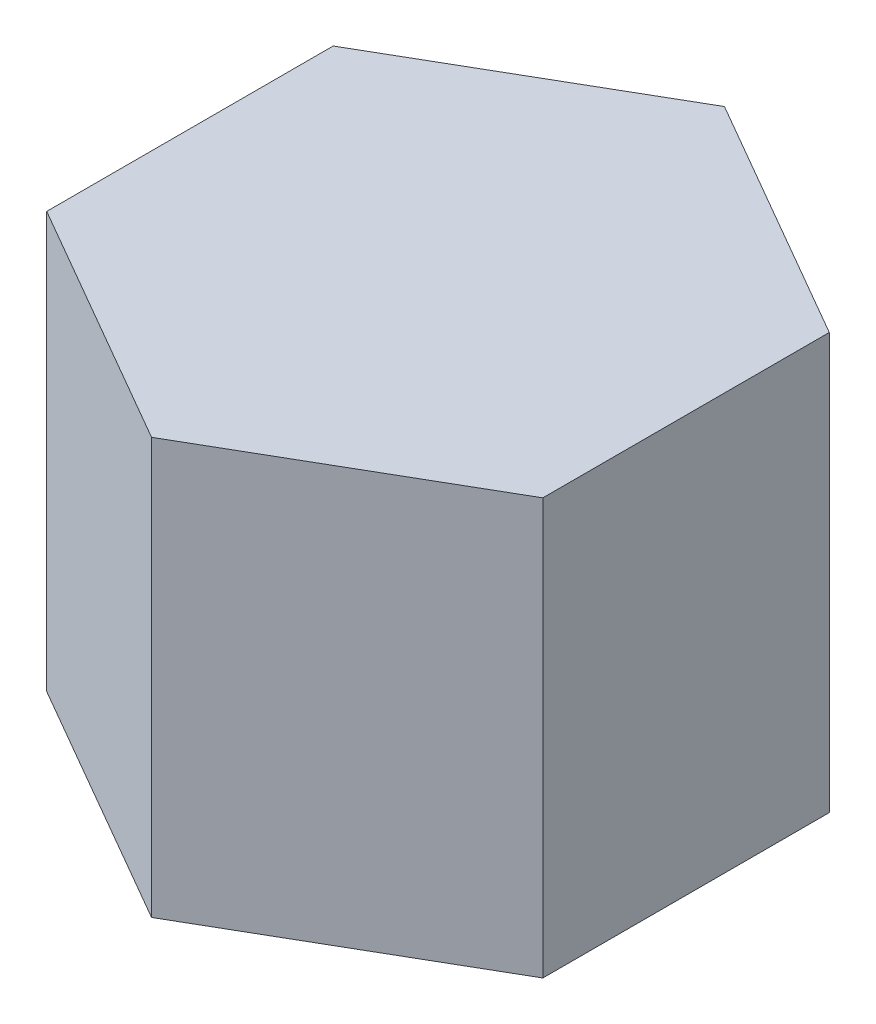
ISO-10303-21;
HEADER;
FILE_DESCRIPTION(('STEP AP214'),'2;1');
FILE_NAME('part.step','',(''),(''),'','','');
FILE_SCHEMA(('AUTOMOTIVE_DESIGN { 1 0 10303 214 1 1 1 1 }'));
ENDSEC;
DATA;
#1=APPLICATION_CONTEXT('core data for automotive mechanical design processes');
#2=APPLICATION_PROTOCOL_DEFINITION('international standard','automotive_design',2000,#1);
#3=PRODUCT_CONTEXT('',#1,'mechanical');
#4=PRODUCT('Part','Part','',(#3));
#5=PRODUCT_RELATED_PRODUCT_CATEGORY('part','',(#4));
#6=PRODUCT_DEFINITION_FORMATION('','',#4);
#7=PRODUCT_DEFINITION_CONTEXT('part definition',#1,'design');
#8=PRODUCT_DEFINITION('design','',#6,#7);
#9=PRODUCT_DEFINITION_SHAPE('','',#8);
#10=(LENGTH_UNIT() NAMED_UNIT(*) SI_UNIT(.MILLI.,.METRE.));
#11=(NAMED_UNIT(*) PLANE_ANGLE_UNIT() SI_UNIT($,.RADIAN.));
#12=(NAMED_UNIT(*) SI_UNIT($,.STERADIAN.) SOLID_ANGLE_UNIT());
#13=UNCERTAINTY_MEASURE_WITH_UNIT(LENGTH_MEASURE(1.E-05),#10,'distance_accuracy_value','');
#14=(GEOMETRIC_REPRESENTATION_CONTEXT(3) GLOBAL_UNCERTAINTY_ASSIGNED_CONTEXT((#13)) GLOBAL_UNIT_ASSIGNED_CONTEXT((#10,
#11,#12)) REPRESENTATION_CONTEXT('',''));
#15=CARTESIAN_POINT('',(0.,0.,0.));
#16=DIRECTION('',(0.,0.,1.));
#17=DIRECTION('',(1.,0.,0.));
#18=AXIS2_PLACEMENT_3D('',#15,#16,#17);
#19=CARTESIAN_POINT('',(206.642660308706,-148.537700895744,293.239022028063));
#20=DIRECTION('',(-0.499999999999909,0.,-0.866025403784491));
#21=DIRECTION('',(-0.866025403784491,0.,0.499999999999909));
#22=AXIS2_PLACEMENT_3D('',#19,#20,#21);
#23=PLANE('',#22);
#24=CARTESIAN_POINT('',(206.339551417382,-149.045793579175,293.414022028063));
#25=DIRECTION('',(0.866025403784491,0.,-0.499999999999909));
#26=VECTOR('',#25,1.);
#27=LINE('',#24,#26);
#28=CARTESIAN_POINT('',(206.339551417382,-149.045793579175,293.414022028063));
#29=VERTEX_POINT('',#28);
#30=CARTESIAN_POINT('',(206.642660308706,-149.045793579175,293.239022028063));
#31=VERTEX_POINT('',#30);
#32=EDGE_CURVE('E170',#29,#31,#27,.T.);
#33=ORIENTED_EDGE('',*,*,#32,.T.);
#34=CARTESIAN_POINT('',(206.642660308706,-148.537700895744,293.239022028063));
#35=DIRECTION('',(0.,-1.,0.));
#36=VECTOR('',#35,1.);
#37=LINE('',#34,#36);
#38=CARTESIAN_POINT('',(206.642660308706,-148.537700895744,293.239022028063));
#39=VERTEX_POINT('',#38);
#40=EDGE_CURVE('E35',#39,#31,#37,.T.);
#41=ORIENTED_EDGE('',*,*,#40,.F.);
#42=CARTESIAN_POINT('',(206.339551417382,-148.537700895744,293.414022028063));
#43=DIRECTION('',(0.866025403784491,0.,-0.499999999999909));
#44=VECTOR('',#43,1.);
#45=LINE('',#42,#44);
#46=CARTESIAN_POINT('',(206.339551417382,-148.537700895744,293.414022028063));
#47=VERTEX_POINT('',#46);
#48=EDGE_CURVE('E159',#47,#39,#45,.T.);
#49=ORIENTED_EDGE('',*,*,#48,.F.);
#50=CARTESIAN_POINT('',(206.339551417382,-148.537700895744,293.414022028063));
#51=DIRECTION('',(0.,-1.,0.));
#52=VECTOR('',#51,1.);
#53=LINE('',#50,#52);
#54=EDGE_CURVE('E10',#47,#29,#53,.T.);
#55=ORIENTED_EDGE('',*,*,#54,.T.);
#56=EDGE_LOOP('',(#33,#41,#49,#55));
#57=FACE_BOUND('',#56,.T.);
#58=ADVANCED_FACE('F16',(#57),#23,.F.);
#59=CARTESIAN_POINT('',(206.339551417382,-148.537700895744,293.414022028063));
#60=DIRECTION('',(0.500000000000062,0.,-0.866025403784403));
#61=DIRECTION('',(-0.866025403784403,0.,-0.500000000000062));
#62=AXIS2_PLACEMENT_3D('',#59,#60,#61);
#63=PLANE('',#62);
#64=CARTESIAN_POINT('',(206.036442526057,-149.045793579175,293.239022028063));
#65=DIRECTION('',(0.866025403784403,0.,0.500000000000062));
#66=VECTOR('',#65,1.);
#67=LINE('',#64,#66);
#68=CARTESIAN_POINT('',(206.036442526057,-149.045793579175,293.239022028063));
#69=VERTEX_POINT('',#68);
#70=EDGE_CURVE('E167',#69,#29,#67,.T.);
#71=ORIENTED_EDGE('',*,*,#70,.T.);
#72=ORIENTED_EDGE('',*,*,#54,.F.);
#73=CARTESIAN_POINT('',(206.036442526057,-148.537700895744,293.239022028063));
#74=DIRECTION('',(0.866025403784403,0.,0.500000000000062));
#75=VECTOR('',#74,1.);
#76=LINE('',#73,#75);
#77=CARTESIAN_POINT('',(206.036442526057,-148.537700895744,293.239022028063));
#78=VERTEX_POINT('',#77);
#79=EDGE_CURVE('E156',#78,#47,#76,.T.);
#80=ORIENTED_EDGE('',*,*,#79,.F.);
#81=CARTESIAN_POINT('',(206.036442526057,-148.537700895744,293.239022028063));
#82=DIRECTION('',(0.,-1.,0.));
#83=VECTOR('',#82,1.);
#84=LINE('',#81,#83);
#85=EDGE_CURVE('E27',#78,#69,#84,.T.);
#86=ORIENTED_EDGE('',*,*,#85,.T.);
#87=EDGE_LOOP('',(#71,#72,#80,#86));
#88=FACE_BOUND('',#87,.T.);
#89=ADVANCED_FACE('F189',(#88),#63,.F.);
#90=CARTESIAN_POINT('',(206.036442526057,-148.537700895744,290.831971220494));
#91=DIRECTION('',(1.,0.,0.));
#92=DIRECTION('',(0.,1.,0.));
#93=AXIS2_PLACEMENT_3D('',#90,#91,#92);
#94=PLANE('',#93);
#95=CARTESIAN_POINT('',(206.036442526057,-149.045793579175,292.889022028063));
#96=DIRECTION('',(0.,0.,1.));
#97=VECTOR('',#96,1.);
#98=LINE('',#95,#97);
#99=CARTESIAN_POINT('',(206.036442526057,-149.045793579175,292.889022028063));
#100=VERTEX_POINT('',#99);
#101=EDGE_CURVE('E163',#100,#69,#98,.T.);
#102=ORIENTED_EDGE('',*,*,#101,.T.);
#103=ORIENTED_EDGE('',*,*,#85,.F.);
#104=CARTESIAN_POINT('',(206.036442526057,-148.537700895744,292.889022028063));
#105=DIRECTION('',(0.,0.,1.));
#106=VECTOR('',#105,1.);
#107=LINE('',#104,#106);
#108=CARTESIAN_POINT('',(206.036442526057,-148.537700895744,292.889022028063));
#109=VERTEX_POINT('',#108);
#110=EDGE_CURVE('E106',#109,#78,#107,.T.);
#111=ORIENTED_EDGE('',*,*,#110,.F.);
#112=CARTESIAN_POINT('',(206.036442526057,-148.537700895744,292.889022028063));
#113=DIRECTION('',(0.,-1.,0.));
#114=VECTOR('',#113,1.);
#115=LINE('',#112,#114);
#116=EDGE_CURVE('E94',#109,#100,#115,.T.);
#117=ORIENTED_EDGE('',*,*,#116,.T.);
#118=EDGE_LOOP('',(#102,#103,#111,#117));
#119=FACE_BOUND('',#118,.T.);
#120=ADVANCED_FACE('F198',(#119),#94,.F.);
#121=CARTESIAN_POINT('',(206.036442526057,-148.537700895744,292.889022028063));
#122=DIRECTION('',(0.499999999999943,0.,0.866025403784472));
#123=DIRECTION('',(0.866025403784472,0.,-0.499999999999943));
#124=AXIS2_PLACEMENT_3D('',#121,#122,#123);
#125=PLANE('',#124);
#126=CARTESIAN_POINT('',(206.339551417382,-149.045793579175,292.714022028063));
#127=DIRECTION('',(-0.866025403784471,0.,0.499999999999943));
#128=VECTOR('',#127,1.);
#129=LINE('',#126,#128);
#130=CARTESIAN_POINT('',(206.339551417382,-149.045793579175,292.714022028063));
#131=VERTEX_POINT('',#130);
#132=EDGE_CURVE('E162',#131,#100,#129,.T.);
#133=ORIENTED_EDGE('',*,*,#132,.T.);
#134=ORIENTED_EDGE('',*,*,#116,.F.);
#135=CARTESIAN_POINT('',(206.339551417382,-148.537700895744,292.714022028063));
#136=DIRECTION('',(-0.866025403784471,0.,0.499999999999943));
#137=VECTOR('',#136,1.);
#138=LINE('',#135,#137);
#139=CARTESIAN_POINT('',(206.339551417382,-148.537700895744,292.714022028063));
#140=VERTEX_POINT('',#139);
#141=EDGE_CURVE('E98',#140,#109,#138,.T.);
#142=ORIENTED_EDGE('',*,*,#141,.F.);
#143=CARTESIAN_POINT('',(206.339551417382,-148.537700895744,292.714022028063));
#144=DIRECTION('',(0.,-1.,0.));
#145=VECTOR('',#144,1.);
#146=LINE('',#143,#145);
#147=EDGE_CURVE('E79',#140,#131,#146,.T.);
#148=ORIENTED_EDGE('',*,*,#147,.T.);
#149=EDGE_LOOP('',(#133,#134,#142,#148));
#150=FACE_BOUND('',#149,.T.);
#151=ADVANCED_FACE('F100',(#150),#125,.F.);
#152=CARTESIAN_POINT('',(206.339551417382,-148.537700895744,292.714022028063));
#153=DIRECTION('',(-0.500000000000096,0.,0.866025403784383));
#154=DIRECTION('',(0.866025403784383,0.,0.500000000000096));
#155=AXIS2_PLACEMENT_3D('',#152,#153,#154);
#156=PLANE('',#155);
#157=CARTESIAN_POINT('',(206.642660308706,-149.045793579175,292.889022028063));
#158=DIRECTION('',(-0.866025403784383,0.,-0.500000000000096));
#159=VECTOR('',#158,1.);
#160=LINE('',#157,#159);
#161=CARTESIAN_POINT('',(206.642660308706,-149.045793579175,292.889022028063));
#162=VERTEX_POINT('',#161);
#163=EDGE_CURVE('E88',#162,#131,#160,.T.);
#164=ORIENTED_EDGE('',*,*,#163,.T.);
#165=ORIENTED_EDGE('',*,*,#147,.F.);
#166=CARTESIAN_POINT('',(206.642660308706,-148.537700895744,292.889022028063));
#167=DIRECTION('',(-0.866025403784383,0.,-0.500000000000096));
#168=VECTOR('',#167,1.);
#169=LINE('',#166,#168);
#170=CARTESIAN_POINT('',(206.642660308706,-148.537700895744,292.889022028063));
#171=VERTEX_POINT('',#170);
#172=EDGE_CURVE('E84',#171,#140,#169,.T.);
#173=ORIENTED_EDGE('',*,*,#172,.F.);
#174=CARTESIAN_POINT('',(206.642660308706,-148.537700895744,292.889022028063));
#175=DIRECTION('',(0.,-1.,0.));
#176=VECTOR('',#175,1.);
#177=LINE('',#174,#176);
#178=EDGE_CURVE('E58',#171,#162,#177,.T.);
#179=ORIENTED_EDGE('',*,*,#178,.T.);
#180=EDGE_LOOP('',(#164,#165,#173,#179));
#181=FACE_BOUND('',#180,.T.);
#182=ADVANCED_FACE('F82',(#181),#156,.F.);
#183=CARTESIAN_POINT('',(206.642660308706,-148.537700895744,290.831971220494));
#184=DIRECTION('',(-1.,0.,0.));
#185=DIRECTION('',(0.,-1.,0.));
#186=AXIS2_PLACEMENT_3D('',#183,#184,#185);
#187=PLANE('',#186);
#188=CARTESIAN_POINT('',(206.642660308706,-149.045793579175,293.239022028063));
#189=DIRECTION('',(0.,0.,-1.));
#190=VECTOR('',#189,1.);
#191=LINE('',#188,#190);
#192=EDGE_CURVE('E160',#31,#162,#191,.T.);
#193=ORIENTED_EDGE('',*,*,#192,.T.);
#194=ORIENTED_EDGE('',*,*,#178,.F.);
#195=CARTESIAN_POINT('',(206.642660308706,-148.537700895744,293.239022028063));
#196=DIRECTION('',(0.,0.,-1.));
#197=VECTOR('',#196,1.);
#198=LINE('',#195,#197);
#199=EDGE_CURVE('E112',#39,#171,#198,.T.);
#200=ORIENTED_EDGE('',*,*,#199,.F.);
#201=ORIENTED_EDGE('',*,*,#40,.T.);
#202=EDGE_LOOP('',(#193,#194,#200,#201));
#203=FACE_BOUND('',#202,.T.);
#204=ADVANCED_FACE('F131',(#203),#187,.F.);
#205=CARTESIAN_POINT('',(206.339551417382,-148.537700895744,290.831971220494));
#206=DIRECTION('',(0.,-1.,0.));
#207=DIRECTION('',(1.,0.,0.));
#208=AXIS2_PLACEMENT_3D('',#205,#206,#207);
#209=PLANE('',#208);
#210=ORIENTED_EDGE('',*,*,#48,.T.);
#211=ORIENTED_EDGE('',*,*,#199,.T.);
#212=ORIENTED_EDGE('',*,*,#172,.T.);
#213=ORIENTED_EDGE('',*,*,#141,.T.);
#214=ORIENTED_EDGE('',*,*,#110,.T.);
#215=ORIENTED_EDGE('',*,*,#79,.T.);
#216=EDGE_LOOP('',(#210,#211,#212,#213,#214,#215));
#217=FACE_BOUND('',#216,.T.);
#218=ADVANCED_FACE('F111',(#217),#209,.F.);
#219=CARTESIAN_POINT('',(206.339551417382,-149.045793579175,290.831971220494));
#220=DIRECTION('',(0.,-1.,0.));
#221=DIRECTION('',(1.,0.,0.));
#222=AXIS2_PLACEMENT_3D('',#219,#220,#221);
#223=PLANE('',#222);
#224=ORIENTED_EDGE('',*,*,#32,.F.);
#225=ORIENTED_EDGE('',*,*,#70,.F.);
#226=ORIENTED_EDGE('',*,*,#101,.F.);
#227=ORIENTED_EDGE('',*,*,#132,.F.);
#228=ORIENTED_EDGE('',*,*,#163,.F.);
#229=ORIENTED_EDGE('',*,*,#192,.F.);
#230=EDGE_LOOP('',(#224,#225,#226,#227,#228,#229));
#231=FACE_BOUND('',#230,.T.);
#232=ADVANCED_FACE('F130',(#231),#223,.T.);
#233=CLOSED_SHELL('',(#58,#89,#120,#151,#182,#204,#218,#232));
#234=MANIFOLD_SOLID_BREP('B1',#233);
#235=ADVANCED_BREP_SHAPE_REPRESENTATION('',(#18,#234),#14);
#236=SHAPE_DEFINITION_REPRESENTATION(#9,#235);
ENDSEC;
END-ISO-10303-21;
